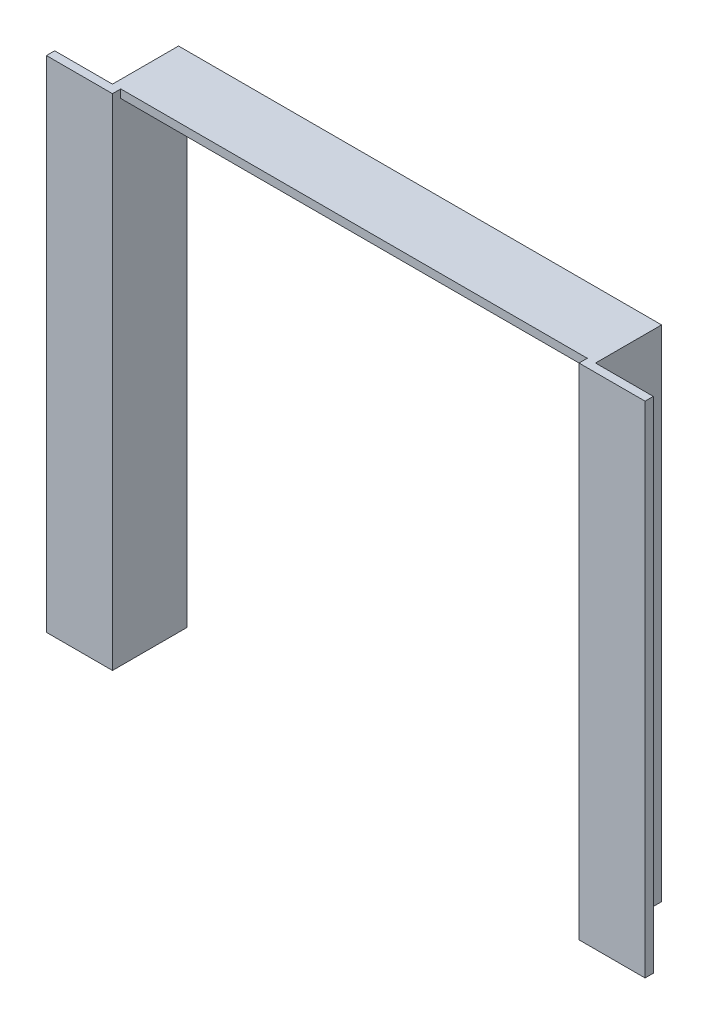
ISO-10303-21;
HEADER;
FILE_DESCRIPTION(('STEP AP214'),'2;1');
FILE_NAME('part.step','',(''),(''),'','','');
FILE_SCHEMA(('AUTOMOTIVE_DESIGN { 1 0 10303 214 1 1 1 1 }'));
ENDSEC;
DATA;
#1=APPLICATION_CONTEXT('core data for automotive mechanical design processes');
#2=APPLICATION_PROTOCOL_DEFINITION('international standard','automotive_design',2000,#1);
#3=PRODUCT_CONTEXT('',#1,'mechanical');
#4=PRODUCT('Part','Part','',(#3));
#5=PRODUCT_RELATED_PRODUCT_CATEGORY('part','',(#4));
#6=PRODUCT_DEFINITION_FORMATION('','',#4);
#7=PRODUCT_DEFINITION_CONTEXT('part definition',#1,'design');
#8=PRODUCT_DEFINITION('design','',#6,#7);
#9=PRODUCT_DEFINITION_SHAPE('','',#8);
#10=(LENGTH_UNIT() NAMED_UNIT(*) SI_UNIT(.MILLI.,.METRE.));
#11=(NAMED_UNIT(*) PLANE_ANGLE_UNIT() SI_UNIT($,.RADIAN.));
#12=(NAMED_UNIT(*) SI_UNIT($,.STERADIAN.) SOLID_ANGLE_UNIT());
#13=UNCERTAINTY_MEASURE_WITH_UNIT(LENGTH_MEASURE(1.E-05),#10,'distance_accuracy_value','');
#14=(GEOMETRIC_REPRESENTATION_CONTEXT(3) GLOBAL_UNCERTAINTY_ASSIGNED_CONTEXT((#13)) GLOBAL_UNIT_ASSIGNED_CONTEXT((#10,
#11,#12)) REPRESENTATION_CONTEXT('',''));
#15=CARTESIAN_POINT('',(0.,0.,0.));
#16=DIRECTION('',(0.,0.,1.));
#17=DIRECTION('',(1.,0.,0.));
#18=AXIS2_PLACEMENT_3D('',#15,#16,#17);
#19=CARTESIAN_POINT('',(-3.175,0.,12.7));
#20=DIRECTION('',(0.,1.,0.));
#21=DIRECTION('',(0.,0.,1.));
#22=AXIS2_PLACEMENT_3D('',#19,#20,#21);
#23=PLANE('',#22);
#24=DIRECTION('',(1.,0.,0.));
#25=VECTOR('',#24,1.);
#26=CARTESIAN_POINT('',(-3.175,0.,-12.7));
#27=LINE('',#26,#25);
#28=CARTESIAN_POINT('',(-3.175,0.,-12.7));
#29=VERTEX_POINT('',#28);
#30=CARTESIAN_POINT('',(0.,0.,-12.7));
#31=VERTEX_POINT('',#30);
#32=EDGE_CURVE('E169',#29,#31,#27,.T.);
#33=ORIENTED_EDGE('',*,*,#32,.T.);
#34=DIRECTION('',(0.,0.,-1.));
#35=VECTOR('',#34,1.);
#36=CARTESIAN_POINT('',(0.,0.,12.7));
#37=LINE('',#36,#35);
#38=CARTESIAN_POINT('',(0.,0.,15.875));
#39=VERTEX_POINT('',#38);
#40=EDGE_CURVE('E162',#39,#31,#37,.T.);
#41=ORIENTED_EDGE('',*,*,#40,.F.);
#42=DIRECTION('',(1.,0.,0.));
#43=VECTOR('',#42,1.);
#44=CARTESIAN_POINT('',(-25.4,0.,15.875));
#45=LINE('',#44,#43);
#46=CARTESIAN_POINT('',(-25.4,0.,15.875));
#47=VERTEX_POINT('',#46);
#48=EDGE_CURVE('E170',#47,#39,#45,.T.);
#49=ORIENTED_EDGE('',*,*,#48,.F.);
#50=DIRECTION('',(0.,0.,-1.));
#51=VECTOR('',#50,1.);
#52=CARTESIAN_POINT('',(-25.4,0.,12.7));
#53=LINE('',#52,#51);
#54=CARTESIAN_POINT('',(-25.4,0.,12.7));
#55=VERTEX_POINT('',#54);
#56=EDGE_CURVE('E158',#47,#55,#53,.T.);
#57=ORIENTED_EDGE('',*,*,#56,.T.);
#58=DIRECTION('',(1.,0.,0.));
#59=VECTOR('',#58,1.);
#60=CARTESIAN_POINT('',(-25.4,0.,12.7));
#61=LINE('',#60,#59);
#62=CARTESIAN_POINT('',(-3.175,0.,12.7));
#63=VERTEX_POINT('',#62);
#64=EDGE_CURVE('E166',#55,#63,#61,.T.);
#65=ORIENTED_EDGE('',*,*,#64,.T.);
#66=DIRECTION('',(0.,0.,-1.));
#67=VECTOR('',#66,1.);
#68=CARTESIAN_POINT('',(-3.175,0.,12.7));
#69=LINE('',#68,#67);
#70=EDGE_CURVE('E53',#63,#29,#69,.T.);
#71=ORIENTED_EDGE('',*,*,#70,.T.);
#72=EDGE_LOOP('',(#33,#41,#49,#57,#65,#71));
#73=FACE_BOUND('',#72,.T.);
#74=ADVANCED_FACE('F32',(#73),#23,.F.);
#75=CARTESIAN_POINT('',(0.,0.,12.7));
#76=DIRECTION('',(-1.,0.,0.));
#77=DIRECTION('',(0.,0.,1.));
#78=AXIS2_PLACEMENT_3D('',#75,#76,#77);
#79=PLANE('',#78);
#80=DIRECTION('',(0.,1.,0.));
#81=VECTOR('',#80,1.);
#82=CARTESIAN_POINT('',(0.,0.,-12.7));
#83=LINE('',#82,#81);
#84=CARTESIAN_POINT('',(0.,188.9125,-12.7));
#85=VERTEX_POINT('',#84);
#86=EDGE_CURVE('E184',#31,#85,#83,.T.);
#87=ORIENTED_EDGE('',*,*,#86,.T.);
#88=DIRECTION('',(0.,0.,-1.));
#89=VECTOR('',#88,1.);
#90=CARTESIAN_POINT('',(0.,188.9125,12.7));
#91=LINE('',#90,#89);
#92=CARTESIAN_POINT('',(0.,188.9125,12.7));
#93=VERTEX_POINT('',#92);
#94=EDGE_CURVE('E205',#93,#85,#91,.T.);
#95=ORIENTED_EDGE('',*,*,#94,.F.);
#96=DIRECTION('',(0.,1.,0.));
#97=VECTOR('',#96,1.);
#98=CARTESIAN_POINT('',(0.,0.,12.7));
#99=LINE('',#98,#97);
#100=CARTESIAN_POINT('',(0.,192.0875,12.7));
#101=VERTEX_POINT('',#100);
#102=EDGE_CURVE('E39',#93,#101,#99,.T.);
#103=ORIENTED_EDGE('',*,*,#102,.T.);
#104=DIRECTION('',(0.,0.,1.));
#105=VECTOR('',#104,1.);
#106=CARTESIAN_POINT('',(0.,192.0875,12.7));
#107=LINE('',#106,#105);
#108=CARTESIAN_POINT('',(0.,192.0875,15.875));
#109=VERTEX_POINT('',#108);
#110=EDGE_CURVE('E133',#101,#109,#107,.T.);
#111=ORIENTED_EDGE('',*,*,#110,.T.);
#112=DIRECTION('',(0.,-1.,0.));
#113=VECTOR('',#112,1.);
#114=CARTESIAN_POINT('',(0.,0.,15.875));
#115=LINE('',#114,#113);
#116=EDGE_CURVE('E137',#109,#39,#115,.T.);
#117=ORIENTED_EDGE('',*,*,#116,.T.);
#118=ORIENTED_EDGE('',*,*,#40,.T.);
#119=EDGE_LOOP('',(#87,#95,#103,#111,#117,#118));
#120=FACE_BOUND('',#119,.T.);
#121=ADVANCED_FACE('F210',(#120),#79,.F.);
#122=CARTESIAN_POINT('',(0.,188.9125,12.7));
#123=DIRECTION('',(0.,1.,0.));
#124=DIRECTION('',(0.,0.,1.));
#125=AXIS2_PLACEMENT_3D('',#122,#123,#124);
#126=PLANE('',#125);
#127=DIRECTION('',(1.,0.,0.));
#128=VECTOR('',#127,1.);
#129=CARTESIAN_POINT('',(0.,188.9125,-12.7));
#130=LINE('',#129,#128);
#131=CARTESIAN_POINT('',(179.3875,188.9125,-12.7));
#132=VERTEX_POINT('',#131);
#133=EDGE_CURVE('E186',#85,#132,#130,.T.);
#134=ORIENTED_EDGE('',*,*,#133,.T.);
#135=DIRECTION('',(0.,0.,-1.));
#136=VECTOR('',#135,1.);
#137=CARTESIAN_POINT('',(179.3875,188.9125,12.7));
#138=LINE('',#137,#136);
#139=CARTESIAN_POINT('',(179.3875,188.9125,12.7));
#140=VERTEX_POINT('',#139);
#141=EDGE_CURVE('E202',#140,#132,#138,.T.);
#142=ORIENTED_EDGE('',*,*,#141,.F.);
#143=DIRECTION('',(1.,0.,0.));
#144=VECTOR('',#143,1.);
#145=CARTESIAN_POINT('',(0.,188.9125,12.7));
#146=LINE('',#145,#144);
#147=EDGE_CURVE('E125',#93,#140,#146,.T.);
#148=ORIENTED_EDGE('',*,*,#147,.F.);
#149=ORIENTED_EDGE('',*,*,#94,.T.);
#150=EDGE_LOOP('',(#134,#142,#148,#149));
#151=FACE_BOUND('',#150,.T.);
#152=ADVANCED_FACE('F222',(#151),#126,.F.);
#153=CARTESIAN_POINT('',(179.3875,188.9125,12.7));
#154=DIRECTION('',(1.,0.,0.));
#155=DIRECTION('',(0.,1.,0.));
#156=AXIS2_PLACEMENT_3D('',#153,#154,#155);
#157=PLANE('',#156);
#158=DIRECTION('',(0.,-1.,0.));
#159=VECTOR('',#158,1.);
#160=CARTESIAN_POINT('',(179.3875,188.9125,-12.7));
#161=LINE('',#160,#159);
#162=CARTESIAN_POINT('',(179.3875,0.,-12.7));
#163=VERTEX_POINT('',#162);
#164=EDGE_CURVE('E188',#132,#163,#161,.T.);
#165=ORIENTED_EDGE('',*,*,#164,.T.);
#166=DIRECTION('',(0.,0.,-1.));
#167=VECTOR('',#166,1.);
#168=CARTESIAN_POINT('',(179.3875,0.,12.7));
#169=LINE('',#168,#167);
#170=CARTESIAN_POINT('',(179.3875,0.,15.875));
#171=VERTEX_POINT('',#170);
#172=EDGE_CURVE('E199',#171,#163,#169,.T.);
#173=ORIENTED_EDGE('',*,*,#172,.F.);
#174=DIRECTION('',(0.,-1.,0.));
#175=VECTOR('',#174,1.);
#176=CARTESIAN_POINT('',(179.3875,0.,15.875));
#177=LINE('',#176,#175);
#178=CARTESIAN_POINT('',(179.3875,192.0875,15.875));
#179=VERTEX_POINT('',#178);
#180=EDGE_CURVE('E232',#179,#171,#177,.T.);
#181=ORIENTED_EDGE('',*,*,#180,.F.);
#182=DIRECTION('',(0.,0.,1.));
#183=VECTOR('',#182,1.);
#184=CARTESIAN_POINT('',(179.3875,192.0875,12.7));
#185=LINE('',#184,#183);
#186=CARTESIAN_POINT('',(179.3875,192.0875,12.7));
#187=VERTEX_POINT('',#186);
#188=EDGE_CURVE('E143',#187,#179,#185,.T.);
#189=ORIENTED_EDGE('',*,*,#188,.F.);
#190=DIRECTION('',(0.,-1.,0.));
#191=VECTOR('',#190,1.);
#192=CARTESIAN_POINT('',(179.3875,0.,12.7));
#193=LINE('',#192,#191);
#194=EDGE_CURVE('E11',#187,#140,#193,.T.);
#195=ORIENTED_EDGE('',*,*,#194,.T.);
#196=ORIENTED_EDGE('',*,*,#141,.T.);
#197=EDGE_LOOP('',(#165,#173,#181,#189,#195,#196));
#198=FACE_BOUND('',#197,.T.);
#199=ADVANCED_FACE('F225',(#198),#157,.F.);
#200=CARTESIAN_POINT('',(179.3875,0.,12.7));
#201=DIRECTION('',(0.,1.,0.));
#202=DIRECTION('',(0.,0.,1.));
#203=AXIS2_PLACEMENT_3D('',#200,#201,#202);
#204=PLANE('',#203);
#205=DIRECTION('',(1.,0.,0.));
#206=VECTOR('',#205,1.);
#207=CARTESIAN_POINT('',(179.3875,0.,-12.7));
#208=LINE('',#207,#206);
#209=CARTESIAN_POINT('',(182.5625,0.,-12.7));
#210=VERTEX_POINT('',#209);
#211=EDGE_CURVE('E190',#163,#210,#208,.T.);
#212=ORIENTED_EDGE('',*,*,#211,.T.);
#213=DIRECTION('',(0.,0.,-1.));
#214=VECTOR('',#213,1.);
#215=CARTESIAN_POINT('',(182.5625,0.,12.7));
#216=LINE('',#215,#214);
#217=CARTESIAN_POINT('',(182.5625,0.,12.7));
#218=VERTEX_POINT('',#217);
#219=EDGE_CURVE('E113',#218,#210,#216,.T.);
#220=ORIENTED_EDGE('',*,*,#219,.F.);
#221=DIRECTION('',(-1.,0.,0.));
#222=VECTOR('',#221,1.);
#223=CARTESIAN_POINT('',(204.7875,0.,12.7));
#224=LINE('',#223,#222);
#225=CARTESIAN_POINT('',(204.7875,0.,12.7));
#226=VERTEX_POINT('',#225);
#227=EDGE_CURVE('E123',#226,#218,#224,.T.);
#228=ORIENTED_EDGE('',*,*,#227,.F.);
#229=DIRECTION('',(0.,0.,-1.));
#230=VECTOR('',#229,1.);
#231=CARTESIAN_POINT('',(204.7875,0.,12.7));
#232=LINE('',#231,#230);
#233=CARTESIAN_POINT('',(204.7875,0.,15.875));
#234=VERTEX_POINT('',#233);
#235=EDGE_CURVE('E234',#234,#226,#232,.T.);
#236=ORIENTED_EDGE('',*,*,#235,.F.);
#237=DIRECTION('',(-1.,0.,0.));
#238=VECTOR('',#237,1.);
#239=CARTESIAN_POINT('',(204.7875,0.,15.875));
#240=LINE('',#239,#238);
#241=EDGE_CURVE('E140',#234,#171,#240,.T.);
#242=ORIENTED_EDGE('',*,*,#241,.T.);
#243=ORIENTED_EDGE('',*,*,#172,.T.);
#244=EDGE_LOOP('',(#212,#220,#228,#236,#242,#243));
#245=FACE_BOUND('',#244,.T.);
#246=ADVANCED_FACE('F253',(#245),#204,.F.);
#247=CARTESIAN_POINT('',(182.5625,0.,12.7));
#248=DIRECTION('',(-1.,0.,0.));
#249=DIRECTION('',(0.,0.,1.));
#250=AXIS2_PLACEMENT_3D('',#247,#248,#249);
#251=PLANE('',#250);
#252=DIRECTION('',(0.,1.,0.));
#253=VECTOR('',#252,1.);
#254=CARTESIAN_POINT('',(182.5625,0.,-12.7));
#255=LINE('',#254,#253);
#256=CARTESIAN_POINT('',(182.5625,192.0875,-12.7));
#257=VERTEX_POINT('',#256);
#258=EDGE_CURVE('E109',#210,#257,#255,.T.);
#259=ORIENTED_EDGE('',*,*,#258,.T.);
#260=DIRECTION('',(0.,0.,-1.));
#261=VECTOR('',#260,1.);
#262=CARTESIAN_POINT('',(182.5625,192.0875,12.7));
#263=LINE('',#262,#261);
#264=CARTESIAN_POINT('',(182.5625,192.0875,12.7));
#265=VERTEX_POINT('',#264);
#266=EDGE_CURVE('E102',#265,#257,#263,.T.);
#267=ORIENTED_EDGE('',*,*,#266,.F.);
#268=DIRECTION('',(0.,1.,0.));
#269=VECTOR('',#268,1.);
#270=CARTESIAN_POINT('',(182.5625,0.,12.7));
#271=LINE('',#270,#269);
#272=EDGE_CURVE('E106',#218,#265,#271,.T.);
#273=ORIENTED_EDGE('',*,*,#272,.F.);
#274=ORIENTED_EDGE('',*,*,#219,.T.);
#275=EDGE_LOOP('',(#259,#267,#273,#274));
#276=FACE_BOUND('',#275,.T.);
#277=ADVANCED_FACE('F104',(#276),#251,.F.);
#278=CARTESIAN_POINT('',(182.5625,192.0875,12.7));
#279=DIRECTION('',(0.,-1.,0.));
#280=DIRECTION('',(1.,0.,0.));
#281=AXIS2_PLACEMENT_3D('',#278,#279,#280);
#282=PLANE('',#281);
#283=DIRECTION('',(-1.,0.,0.));
#284=VECTOR('',#283,1.);
#285=CARTESIAN_POINT('',(182.5625,192.0875,-12.7));
#286=LINE('',#285,#284);
#287=CARTESIAN_POINT('',(-3.17500000000004,192.0875,-12.7));
#288=VERTEX_POINT('',#287);
#289=EDGE_CURVE('E193',#257,#288,#286,.T.);
#290=ORIENTED_EDGE('',*,*,#289,.T.);
#291=DIRECTION('',(0.,0.,-1.));
#292=VECTOR('',#291,1.);
#293=CARTESIAN_POINT('',(-3.17500000000004,192.0875,12.7));
#294=LINE('',#293,#292);
#295=CARTESIAN_POINT('',(-3.17500000000004,192.0875,12.7));
#296=VERTEX_POINT('',#295);
#297=EDGE_CURVE('E114',#296,#288,#294,.T.);
#298=ORIENTED_EDGE('',*,*,#297,.F.);
#299=DIRECTION('',(1.,0.,0.));
#300=VECTOR('',#299,1.);
#301=CARTESIAN_POINT('',(-25.4,192.0875,12.7));
#302=LINE('',#301,#300);
#303=CARTESIAN_POINT('',(-25.4,192.0875,12.7));
#304=VERTEX_POINT('',#303);
#305=EDGE_CURVE('E161',#304,#296,#302,.T.);
#306=ORIENTED_EDGE('',*,*,#305,.F.);
#307=DIRECTION('',(0.,0.,1.));
#308=VECTOR('',#307,1.);
#309=CARTESIAN_POINT('',(-25.4,192.0875,12.7));
#310=LINE('',#309,#308);
#311=CARTESIAN_POINT('',(-25.4,192.0875,15.875));
#312=VERTEX_POINT('',#311);
#313=EDGE_CURVE('E152',#304,#312,#310,.T.);
#314=ORIENTED_EDGE('',*,*,#313,.T.);
#315=DIRECTION('',(1.,0.,0.));
#316=VECTOR('',#315,1.);
#317=CARTESIAN_POINT('',(-25.4,192.0875,15.875));
#318=LINE('',#317,#316);
#319=EDGE_CURVE('E173',#312,#109,#318,.T.);
#320=ORIENTED_EDGE('',*,*,#319,.T.);
#321=ORIENTED_EDGE('',*,*,#110,.F.);
#322=DIRECTION('',(-1.,0.,0.));
#323=VECTOR('',#322,1.);
#324=CARTESIAN_POINT('',(182.5625,192.0875,12.7));
#325=LINE('',#324,#323);
#326=EDGE_CURVE('E124',#187,#101,#325,.T.);
#327=ORIENTED_EDGE('',*,*,#326,.F.);
#328=ORIENTED_EDGE('',*,*,#188,.T.);
#329=DIRECTION('',(-1.,0.,0.));
#330=VECTOR('',#329,1.);
#331=CARTESIAN_POINT('',(204.7875,192.0875,15.875));
#332=LINE('',#331,#330);
#333=CARTESIAN_POINT('',(204.7875,192.0875,15.875));
#334=VERTEX_POINT('',#333);
#335=EDGE_CURVE('E134',#334,#179,#332,.T.);
#336=ORIENTED_EDGE('',*,*,#335,.F.);
#337=DIRECTION('',(0.,0.,1.));
#338=VECTOR('',#337,1.);
#339=CARTESIAN_POINT('',(204.7875,192.0875,12.7));
#340=LINE('',#339,#338);
#341=CARTESIAN_POINT('',(204.7875,192.0875,12.7));
#342=VERTEX_POINT('',#341);
#343=EDGE_CURVE('E131',#342,#334,#340,.T.);
#344=ORIENTED_EDGE('',*,*,#343,.F.);
#345=DIRECTION('',(-1.,0.,0.));
#346=VECTOR('',#345,1.);
#347=CARTESIAN_POINT('',(204.7875,192.0875,12.7));
#348=LINE('',#347,#346);
#349=EDGE_CURVE('E121',#342,#265,#348,.T.);
#350=ORIENTED_EDGE('',*,*,#349,.T.);
#351=ORIENTED_EDGE('',*,*,#266,.T.);
#352=EDGE_LOOP('',(#290,#298,#306,#314,#320,#321,#327,#328,#336,#344,#350,#351));
#353=FACE_BOUND('',#352,.T.);
#354=ADVANCED_FACE('F128',(#353),#282,.F.);
#355=CARTESIAN_POINT('',(-3.17500000000004,192.0875,12.7));
#356=DIRECTION('',(1.,0.,0.));
#357=DIRECTION('',(0.,1.,0.));
#358=AXIS2_PLACEMENT_3D('',#355,#356,#357);
#359=PLANE('',#358);
#360=DIRECTION('',(0.,-1.,0.));
#361=VECTOR('',#360,1.);
#362=CARTESIAN_POINT('',(-3.17500000000004,192.0875,-12.7));
#363=LINE('',#362,#361);
#364=EDGE_CURVE('E85',#288,#29,#363,.T.);
#365=ORIENTED_EDGE('',*,*,#364,.T.);
#366=ORIENTED_EDGE('',*,*,#70,.F.);
#367=DIRECTION('',(0.,-1.,0.));
#368=VECTOR('',#367,1.);
#369=CARTESIAN_POINT('',(-3.17500000000004,192.0875,12.7));
#370=LINE('',#369,#368);
#371=EDGE_CURVE('E180',#296,#63,#370,.T.);
#372=ORIENTED_EDGE('',*,*,#371,.F.);
#373=ORIENTED_EDGE('',*,*,#297,.T.);
#374=EDGE_LOOP('',(#365,#366,#372,#373));
#375=FACE_BOUND('',#374,.T.);
#376=ADVANCED_FACE('F255',(#375),#359,.F.);
#377=CARTESIAN_POINT('',(0.,0.,12.7));
#378=DIRECTION('',(0.,0.,1.));
#379=DIRECTION('',(1.,0.,0.));
#380=AXIS2_PLACEMENT_3D('',#377,#378,#379);
#381=PLANE('',#380);
#382=ORIENTED_EDGE('',*,*,#194,.F.);
#383=ORIENTED_EDGE('',*,*,#326,.T.);
#384=ORIENTED_EDGE('',*,*,#102,.F.);
#385=ORIENTED_EDGE('',*,*,#147,.T.);
#386=EDGE_LOOP('',(#382,#383,#384,#385));
#387=FACE_BOUND('',#386,.T.);
#388=ADVANCED_FACE('F279',(#387),#381,.T.);
#389=CARTESIAN_POINT('',(0.,0.,-12.7));
#390=DIRECTION('',(0.,0.,1.));
#391=DIRECTION('',(1.,0.,0.));
#392=AXIS2_PLACEMENT_3D('',#389,#390,#391);
#393=PLANE('',#392);
#394=ORIENTED_EDGE('',*,*,#32,.F.);
#395=ORIENTED_EDGE('',*,*,#364,.F.);
#396=ORIENTED_EDGE('',*,*,#289,.F.);
#397=ORIENTED_EDGE('',*,*,#258,.F.);
#398=ORIENTED_EDGE('',*,*,#211,.F.);
#399=ORIENTED_EDGE('',*,*,#164,.F.);
#400=ORIENTED_EDGE('',*,*,#133,.F.);
#401=ORIENTED_EDGE('',*,*,#86,.F.);
#402=EDGE_LOOP('',(#394,#395,#396,#397,#398,#399,#400,#401));
#403=FACE_BOUND('',#402,.T.);
#404=ADVANCED_FACE('F216',(#403),#393,.F.);
#405=CARTESIAN_POINT('',(-25.4,0.,12.7));
#406=DIRECTION('',(0.,0.,-1.));
#407=DIRECTION('',(-1.,0.,0.));
#408=AXIS2_PLACEMENT_3D('',#405,#406,#407);
#409=PLANE('',#408);
#410=ORIENTED_EDGE('',*,*,#305,.T.);
#411=ORIENTED_EDGE('',*,*,#371,.T.);
#412=ORIENTED_EDGE('',*,*,#64,.F.);
#413=DIRECTION('',(0.,1.,0.));
#414=VECTOR('',#413,1.);
#415=CARTESIAN_POINT('',(-25.4,0.,12.7));
#416=LINE('',#415,#414);
#417=EDGE_CURVE('E149',#55,#304,#416,.T.);
#418=ORIENTED_EDGE('',*,*,#417,.T.);
#419=EDGE_LOOP('',(#410,#411,#412,#418));
#420=FACE_BOUND('',#419,.T.);
#421=ADVANCED_FACE('F258',(#420),#409,.T.);
#422=CARTESIAN_POINT('',(-25.4,0.,15.875));
#423=DIRECTION('',(0.,0.,1.));
#424=DIRECTION('',(1.,0.,0.));
#425=AXIS2_PLACEMENT_3D('',#422,#423,#424);
#426=PLANE('',#425);
#427=ORIENTED_EDGE('',*,*,#116,.F.);
#428=ORIENTED_EDGE('',*,*,#319,.F.);
#429=DIRECTION('',(0.,-1.,0.));
#430=VECTOR('',#429,1.);
#431=CARTESIAN_POINT('',(-25.4,0.,15.875));
#432=LINE('',#431,#430);
#433=EDGE_CURVE('E155',#312,#47,#432,.T.);
#434=ORIENTED_EDGE('',*,*,#433,.T.);
#435=ORIENTED_EDGE('',*,*,#48,.T.);
#436=EDGE_LOOP('',(#427,#428,#434,#435));
#437=FACE_BOUND('',#436,.T.);
#438=ADVANCED_FACE('F272',(#437),#426,.T.);
#439=CARTESIAN_POINT('',(-25.4,0.,0.));
#440=DIRECTION('',(1.,0.,0.));
#441=DIRECTION('',(0.,0.,-1.));
#442=AXIS2_PLACEMENT_3D('',#439,#440,#441);
#443=PLANE('',#442);
#444=ORIENTED_EDGE('',*,*,#417,.F.);
#445=ORIENTED_EDGE('',*,*,#56,.F.);
#446=ORIENTED_EDGE('',*,*,#433,.F.);
#447=ORIENTED_EDGE('',*,*,#313,.F.);
#448=EDGE_LOOP('',(#444,#445,#446,#447));
#449=FACE_BOUND('',#448,.T.);
#450=ADVANCED_FACE('F266',(#449),#443,.F.);
#451=CARTESIAN_POINT('',(204.7875,0.,12.7));
#452=DIRECTION('',(0.,0.,1.));
#453=DIRECTION('',(1.,0.,0.));
#454=AXIS2_PLACEMENT_3D('',#451,#452,#453);
#455=PLANE('',#454);
#456=ORIENTED_EDGE('',*,*,#227,.T.);
#457=ORIENTED_EDGE('',*,*,#272,.T.);
#458=ORIENTED_EDGE('',*,*,#349,.F.);
#459=DIRECTION('',(0.,1.,0.));
#460=VECTOR('',#459,1.);
#461=CARTESIAN_POINT('',(204.7875,0.,12.7));
#462=LINE('',#461,#460);
#463=EDGE_CURVE('E233',#226,#342,#462,.T.);
#464=ORIENTED_EDGE('',*,*,#463,.F.);
#465=EDGE_LOOP('',(#456,#457,#458,#464));
#466=FACE_BOUND('',#465,.T.);
#467=ADVANCED_FACE('F118',(#466),#455,.F.);
#468=CARTESIAN_POINT('',(204.7875,0.,15.875));
#469=DIRECTION('',(0.,0.,-1.));
#470=DIRECTION('',(-1.,0.,0.));
#471=AXIS2_PLACEMENT_3D('',#468,#469,#470);
#472=PLANE('',#471);
#473=ORIENTED_EDGE('',*,*,#180,.T.);
#474=ORIENTED_EDGE('',*,*,#241,.F.);
#475=DIRECTION('',(0.,-1.,0.));
#476=VECTOR('',#475,1.);
#477=CARTESIAN_POINT('',(204.7875,0.,15.875));
#478=LINE('',#477,#476);
#479=EDGE_CURVE('E241',#334,#234,#478,.T.);
#480=ORIENTED_EDGE('',*,*,#479,.F.);
#481=ORIENTED_EDGE('',*,*,#335,.T.);
#482=EDGE_LOOP('',(#473,#474,#480,#481));
#483=FACE_BOUND('',#482,.T.);
#484=ADVANCED_FACE('F402',(#483),#472,.F.);
#485=CARTESIAN_POINT('',(204.7875,0.,0.));
#486=DIRECTION('',(-1.,0.,0.));
#487=DIRECTION('',(0.,0.,-1.));
#488=AXIS2_PLACEMENT_3D('',#485,#486,#487);
#489=PLANE('',#488);
#490=ORIENTED_EDGE('',*,*,#463,.T.);
#491=ORIENTED_EDGE('',*,*,#343,.T.);
#492=ORIENTED_EDGE('',*,*,#479,.T.);
#493=ORIENTED_EDGE('',*,*,#235,.T.);
#494=EDGE_LOOP('',(#490,#491,#492,#493));
#495=FACE_BOUND('',#494,.T.);
#496=ADVANCED_FACE('F248',(#495),#489,.F.);
#497=CLOSED_SHELL('',(#74,#121,#152,#199,#246,#277,#354,#376,#388,#404,#421,#438,#450,#467,#484,#496));
#498=MANIFOLD_SOLID_BREP('B2',#497);
#499=ADVANCED_BREP_SHAPE_REPRESENTATION('',(#18,#498),#14);
#500=SHAPE_DEFINITION_REPRESENTATION(#9,#499);
ENDSEC;
END-ISO-10303-21;
